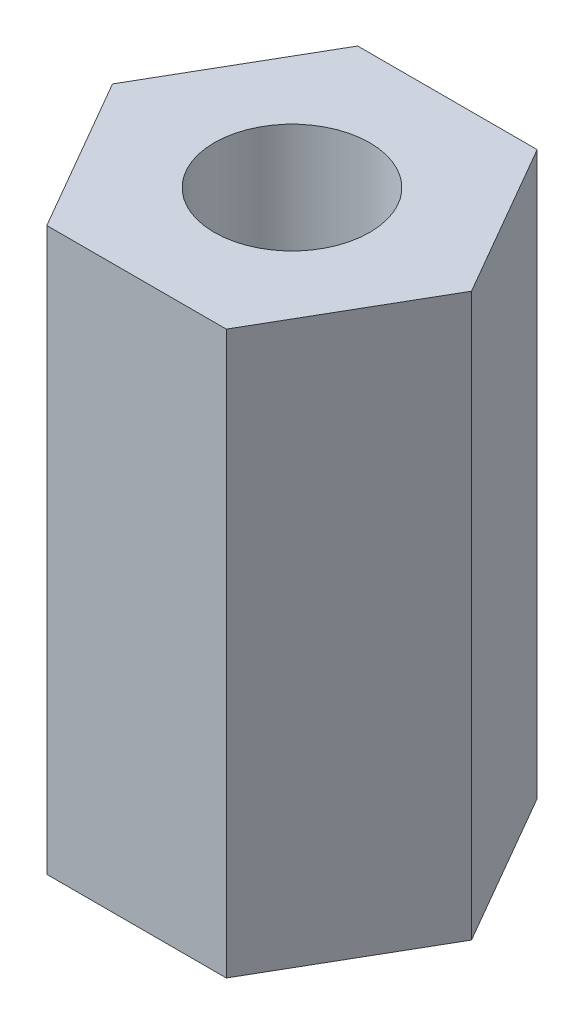
ISO-10303-21;
HEADER;
FILE_DESCRIPTION(('STEP AP214'),'2;1');
FILE_NAME('part.step','',(''),(''),'','','');
FILE_SCHEMA(('AUTOMOTIVE_DESIGN { 1 0 10303 214 1 1 1 1 }'));
ENDSEC;
DATA;
#1=APPLICATION_CONTEXT('core data for automotive mechanical design processes');
#2=APPLICATION_PROTOCOL_DEFINITION('international standard','automotive_design',2000,#1);
#3=PRODUCT_CONTEXT('',#1,'mechanical');
#4=PRODUCT('Part','Part','',(#3));
#5=PRODUCT_RELATED_PRODUCT_CATEGORY('part','',(#4));
#6=PRODUCT_DEFINITION_FORMATION('','',#4);
#7=PRODUCT_DEFINITION_CONTEXT('part definition',#1,'design');
#8=PRODUCT_DEFINITION('design','',#6,#7);
#9=PRODUCT_DEFINITION_SHAPE('','',#8);
#10=(LENGTH_UNIT() NAMED_UNIT(*) SI_UNIT(.MILLI.,.METRE.));
#11=(NAMED_UNIT(*) PLANE_ANGLE_UNIT() SI_UNIT($,.RADIAN.));
#12=(NAMED_UNIT(*) SI_UNIT($,.STERADIAN.) SOLID_ANGLE_UNIT());
#13=UNCERTAINTY_MEASURE_WITH_UNIT(LENGTH_MEASURE(1.E-05),#10,'distance_accuracy_value','');
#14=(GEOMETRIC_REPRESENTATION_CONTEXT(3) GLOBAL_UNCERTAINTY_ASSIGNED_CONTEXT((#13)) GLOBAL_UNIT_ASSIGNED_CONTEXT((#10,
#11,#12)) REPRESENTATION_CONTEXT('',''));
#15=CARTESIAN_POINT('',(0.,0.,0.));
#16=DIRECTION('',(0.,0.,1.));
#17=DIRECTION('',(1.,0.,0.));
#18=AXIS2_PLACEMENT_3D('',#15,#16,#17);
#19=CARTESIAN_POINT('',(0.,7.23,0.));
#20=DIRECTION('',(0.,1.,0.));
#21=DIRECTION('',(0.,0.,1.));
#22=AXIS2_PLACEMENT_3D('',#19,#20,#21);
#23=PLANE('',#22);
#24=DIRECTION('',(0.499999999999995,0.,-0.866025403784442));
#25=VECTOR('',#24,1.);
#26=CARTESIAN_POINT('',(1.15470053837928,7.23,1.99999999999999));
#27=LINE('',#26,#25);
#28=CARTESIAN_POINT('',(1.15470053837928,7.23,1.99999999999999));
#29=VERTEX_POINT('',#28);
#30=CARTESIAN_POINT('',(2.3094010767585,7.23,0.));
#31=VERTEX_POINT('',#30);
#32=EDGE_CURVE('E146',#29,#31,#27,.T.);
#33=ORIENTED_EDGE('',*,*,#32,.T.);
#34=DIRECTION('',(-0.500000000000001,0.,-0.866025403784438));
#35=VECTOR('',#34,1.);
#36=CARTESIAN_POINT('',(2.3094010767585,7.23,0.));
#37=LINE('',#36,#35);
#38=CARTESIAN_POINT('',(1.15470053837925,7.23,-2.));
#39=VERTEX_POINT('',#38);
#40=EDGE_CURVE('E94',#31,#39,#37,.T.);
#41=ORIENTED_EDGE('',*,*,#40,.T.);
#42=DIRECTION('',(-1.,0.,0.));
#43=VECTOR('',#42,1.);
#44=CARTESIAN_POINT('',(1.15470053837925,7.23,-2.));
#45=LINE('',#44,#43);
#46=CARTESIAN_POINT('',(-1.15470053837926,7.23,-2.));
#47=VERTEX_POINT('',#46);
#48=EDGE_CURVE('E107',#39,#47,#45,.T.);
#49=ORIENTED_EDGE('',*,*,#48,.T.);
#50=DIRECTION('',(-0.499999999999995,0.,0.866025403784442));
#51=VECTOR('',#50,1.);
#52=CARTESIAN_POINT('',(-1.15470053837926,7.23,-2.));
#53=LINE('',#52,#51);
#54=CARTESIAN_POINT('',(-2.3094010767585,7.23,0.));
#55=VERTEX_POINT('',#54);
#56=EDGE_CURVE('E101',#47,#55,#53,.T.);
#57=ORIENTED_EDGE('',*,*,#56,.T.);
#58=DIRECTION('',(0.500000000000007,0.,0.866025403784435));
#59=VECTOR('',#58,1.);
#60=CARTESIAN_POINT('',(-2.3094010767585,7.23,0.));
#61=LINE('',#60,#59);
#62=CARTESIAN_POINT('',(-1.15470053837923,7.23,2.00000000000001));
#63=VERTEX_POINT('',#62);
#64=EDGE_CURVE('E105',#55,#63,#61,.T.);
#65=ORIENTED_EDGE('',*,*,#64,.T.);
#66=DIRECTION('',(1.,0.,0.));
#67=VECTOR('',#66,1.);
#68=CARTESIAN_POINT('',(-1.15470053837923,7.23,2.00000000000001));
#69=LINE('',#68,#67);
#70=EDGE_CURVE('E57',#63,#29,#69,.T.);
#71=ORIENTED_EDGE('',*,*,#70,.T.);
#72=EDGE_LOOP('',(#33,#41,#49,#57,#65,#71));
#73=FACE_BOUND('',#72,.T.);
#74=CARTESIAN_POINT('',(0.,7.23,0.));
#75=DIRECTION('',(0.,1.,0.));
#76=DIRECTION('',(0.,0.,1.));
#77=AXIS2_PLACEMENT_3D('',#74,#75,#76);
#78=CIRCLE('',#77,1.);
#79=CARTESIAN_POINT('',(0.,7.23,1.));
#80=VERTEX_POINT('',#79);
#81=EDGE_CURVE('E134',#80,#80,#78,.T.);
#82=ORIENTED_EDGE('',*,*,#81,.F.);
#83=EDGE_LOOP('',(#82));
#84=FACE_BOUND('',#83,.T.);
#85=ADVANCED_FACE('F39',(#73,#84),#23,.T.);
#86=CARTESIAN_POINT('',(0.,0.,0.));
#87=DIRECTION('',(0.,1.,0.));
#88=DIRECTION('',(0.,0.,1.));
#89=AXIS2_PLACEMENT_3D('',#86,#87,#88);
#90=PLANE('',#89);
#91=DIRECTION('',(0.499999999999995,0.,-0.866025403784442));
#92=VECTOR('',#91,1.);
#93=CARTESIAN_POINT('',(1.15470053837928,0.,1.99999999999999));
#94=LINE('',#93,#92);
#95=CARTESIAN_POINT('',(1.15470053837928,0.,1.99999999999999));
#96=VERTEX_POINT('',#95);
#97=CARTESIAN_POINT('',(2.3094010767585,0.,0.));
#98=VERTEX_POINT('',#97);
#99=EDGE_CURVE('E129',#96,#98,#94,.T.);
#100=ORIENTED_EDGE('',*,*,#99,.F.);
#101=DIRECTION('',(1.,0.,0.));
#102=VECTOR('',#101,1.);
#103=CARTESIAN_POINT('',(-1.15470053837923,0.,2.00000000000001));
#104=LINE('',#103,#102);
#105=CARTESIAN_POINT('',(-1.15470053837923,0.,2.00000000000001));
#106=VERTEX_POINT('',#105);
#107=EDGE_CURVE('E86',#106,#96,#104,.T.);
#108=ORIENTED_EDGE('',*,*,#107,.F.);
#109=DIRECTION('',(0.500000000000007,0.,0.866025403784435));
#110=VECTOR('',#109,1.);
#111=CARTESIAN_POINT('',(-2.3094010767585,0.,0.));
#112=LINE('',#111,#110);
#113=CARTESIAN_POINT('',(-2.3094010767585,0.,0.));
#114=VERTEX_POINT('',#113);
#115=EDGE_CURVE('E80',#114,#106,#112,.T.);
#116=ORIENTED_EDGE('',*,*,#115,.F.);
#117=DIRECTION('',(-0.499999999999995,0.,0.866025403784442));
#118=VECTOR('',#117,1.);
#119=CARTESIAN_POINT('',(-1.15470053837926,0.,-2.));
#120=LINE('',#119,#118);
#121=CARTESIAN_POINT('',(-1.15470053837926,0.,-2.));
#122=VERTEX_POINT('',#121);
#123=EDGE_CURVE('E116',#122,#114,#120,.T.);
#124=ORIENTED_EDGE('',*,*,#123,.F.);
#125=DIRECTION('',(-1.,0.,0.));
#126=VECTOR('',#125,1.);
#127=CARTESIAN_POINT('',(1.15470053837925,0.,-2.));
#128=LINE('',#127,#126);
#129=CARTESIAN_POINT('',(1.15470053837925,0.,-2.));
#130=VERTEX_POINT('',#129);
#131=EDGE_CURVE('E137',#130,#122,#128,.T.);
#132=ORIENTED_EDGE('',*,*,#131,.F.);
#133=DIRECTION('',(-0.500000000000001,0.,-0.866025403784438));
#134=VECTOR('',#133,1.);
#135=CARTESIAN_POINT('',(2.3094010767585,0.,0.));
#136=LINE('',#135,#134);
#137=EDGE_CURVE('E133',#98,#130,#136,.T.);
#138=ORIENTED_EDGE('',*,*,#137,.F.);
#139=EDGE_LOOP('',(#100,#108,#116,#124,#132,#138));
#140=FACE_BOUND('',#139,.T.);
#141=CARTESIAN_POINT('',(0.,0.,0.));
#142=DIRECTION('',(0.,1.,0.));
#143=DIRECTION('',(0.,0.,1.));
#144=AXIS2_PLACEMENT_3D('',#141,#142,#143);
#145=CIRCLE('',#144,1.);
#146=CARTESIAN_POINT('',(0.,0.,1.));
#147=VERTEX_POINT('',#146);
#148=EDGE_CURVE('E243',#147,#147,#145,.T.);
#149=ORIENTED_EDGE('',*,*,#148,.T.);
#150=EDGE_LOOP('',(#149));
#151=FACE_BOUND('',#150,.T.);
#152=ADVANCED_FACE('F159',(#140,#151),#90,.F.);
#153=CARTESIAN_POINT('',(1.15470053837928,7.23,1.99999999999999));
#154=DIRECTION('',(-0.866025403784441,0.,-0.499999999999995));
#155=DIRECTION('',(-0.499999999999995,0.,0.866025403784442));
#156=AXIS2_PLACEMENT_3D('',#153,#154,#155);
#157=PLANE('',#156);
#158=ORIENTED_EDGE('',*,*,#99,.T.);
#159=DIRECTION('',(0.,-1.,0.));
#160=VECTOR('',#159,1.);
#161=CARTESIAN_POINT('',(2.3094010767585,7.23,0.));
#162=LINE('',#161,#160);
#163=EDGE_CURVE('E11',#31,#98,#162,.T.);
#164=ORIENTED_EDGE('',*,*,#163,.F.);
#165=ORIENTED_EDGE('',*,*,#32,.F.);
#166=DIRECTION('',(0.,-1.,0.));
#167=VECTOR('',#166,1.);
#168=CARTESIAN_POINT('',(1.15470053837928,7.23,1.99999999999999));
#169=LINE('',#168,#167);
#170=EDGE_CURVE('E125',#29,#96,#169,.T.);
#171=ORIENTED_EDGE('',*,*,#170,.T.);
#172=EDGE_LOOP('',(#158,#164,#165,#171));
#173=FACE_BOUND('',#172,.T.);
#174=ADVANCED_FACE('F41',(#173),#157,.F.);
#175=CARTESIAN_POINT('',(2.3094010767585,7.23,0.));
#176=DIRECTION('',(-0.866025403784438,0.,0.500000000000001));
#177=DIRECTION('',(0.500000000000001,0.,0.866025403784438));
#178=AXIS2_PLACEMENT_3D('',#175,#176,#177);
#179=PLANE('',#178);
#180=ORIENTED_EDGE('',*,*,#137,.T.);
#181=DIRECTION('',(0.,-1.,0.));
#182=VECTOR('',#181,1.);
#183=CARTESIAN_POINT('',(1.15470053837925,7.23,-2.));
#184=LINE('',#183,#182);
#185=EDGE_CURVE('E49',#39,#130,#184,.T.);
#186=ORIENTED_EDGE('',*,*,#185,.F.);
#187=ORIENTED_EDGE('',*,*,#40,.F.);
#188=ORIENTED_EDGE('',*,*,#163,.T.);
#189=EDGE_LOOP('',(#180,#186,#187,#188));
#190=FACE_BOUND('',#189,.T.);
#191=ADVANCED_FACE('F184',(#190),#179,.F.);
#192=CARTESIAN_POINT('',(1.15470053837925,7.23,-2.));
#193=DIRECTION('',(0.,0.,1.));
#194=DIRECTION('',(1.,0.,0.));
#195=AXIS2_PLACEMENT_3D('',#192,#193,#194);
#196=PLANE('',#195);
#197=ORIENTED_EDGE('',*,*,#131,.T.);
#198=DIRECTION('',(0.,-1.,0.));
#199=VECTOR('',#198,1.);
#200=CARTESIAN_POINT('',(-1.15470053837926,7.23,-2.));
#201=LINE('',#200,#199);
#202=EDGE_CURVE('E118',#47,#122,#201,.T.);
#203=ORIENTED_EDGE('',*,*,#202,.F.);
#204=ORIENTED_EDGE('',*,*,#48,.F.);
#205=ORIENTED_EDGE('',*,*,#185,.T.);
#206=EDGE_LOOP('',(#197,#203,#204,#205));
#207=FACE_BOUND('',#206,.T.);
#208=ADVANCED_FACE('F156',(#207),#196,.F.);
#209=CARTESIAN_POINT('',(-1.15470053837926,7.23,-2.));
#210=DIRECTION('',(0.866025403784442,0.,0.499999999999995));
#211=DIRECTION('',(0.499999999999995,0.,-0.866025403784442));
#212=AXIS2_PLACEMENT_3D('',#209,#210,#211);
#213=PLANE('',#212);
#214=ORIENTED_EDGE('',*,*,#123,.T.);
#215=DIRECTION('',(0.,-1.,0.));
#216=VECTOR('',#215,1.);
#217=CARTESIAN_POINT('',(-2.3094010767585,7.23,0.));
#218=LINE('',#217,#216);
#219=EDGE_CURVE('E113',#55,#114,#218,.T.);
#220=ORIENTED_EDGE('',*,*,#219,.F.);
#221=ORIENTED_EDGE('',*,*,#56,.F.);
#222=ORIENTED_EDGE('',*,*,#202,.T.);
#223=EDGE_LOOP('',(#214,#220,#221,#222));
#224=FACE_BOUND('',#223,.T.);
#225=ADVANCED_FACE('F114',(#224),#213,.F.);
#226=CARTESIAN_POINT('',(-2.3094010767585,7.23,0.));
#227=DIRECTION('',(0.866025403784435,0.,-0.500000000000007));
#228=DIRECTION('',(-0.500000000000007,0.,-0.866025403784435));
#229=AXIS2_PLACEMENT_3D('',#226,#227,#228);
#230=PLANE('',#229);
#231=ORIENTED_EDGE('',*,*,#115,.T.);
#232=DIRECTION('',(0.,-1.,0.));
#233=VECTOR('',#232,1.);
#234=CARTESIAN_POINT('',(-1.15470053837923,7.23,2.00000000000001));
#235=LINE('',#234,#233);
#236=EDGE_CURVE('E119',#63,#106,#235,.T.);
#237=ORIENTED_EDGE('',*,*,#236,.F.);
#238=ORIENTED_EDGE('',*,*,#64,.F.);
#239=ORIENTED_EDGE('',*,*,#219,.T.);
#240=EDGE_LOOP('',(#231,#237,#238,#239));
#241=FACE_BOUND('',#240,.T.);
#242=ADVANCED_FACE('F121',(#241),#230,.F.);
#243=CARTESIAN_POINT('',(-1.15470053837923,7.23,2.00000000000001));
#244=DIRECTION('',(0.,0.,-1.));
#245=DIRECTION('',(-1.,0.,0.));
#246=AXIS2_PLACEMENT_3D('',#243,#244,#245);
#247=PLANE('',#246);
#248=ORIENTED_EDGE('',*,*,#107,.T.);
#249=ORIENTED_EDGE('',*,*,#170,.F.);
#250=ORIENTED_EDGE('',*,*,#70,.F.);
#251=ORIENTED_EDGE('',*,*,#236,.T.);
#252=EDGE_LOOP('',(#248,#249,#250,#251));
#253=FACE_BOUND('',#252,.T.);
#254=ADVANCED_FACE('F164',(#253),#247,.F.);
#255=CARTESIAN_POINT('',(0.,7.23,0.));
#256=DIRECTION('',(0.,-1.,0.));
#257=DIRECTION('',(0.,0.,-1.));
#258=AXIS2_PLACEMENT_3D('',#255,#256,#257);
#259=CYLINDRICAL_SURFACE('',#258,1.);
#260=ORIENTED_EDGE('',*,*,#81,.T.);
#261=EDGE_LOOP('',(#260));
#262=FACE_BOUND('',#261,.T.);
#263=ORIENTED_EDGE('',*,*,#148,.F.);
#264=EDGE_LOOP('',(#263));
#265=FACE_BOUND('',#264,.T.);
#266=ADVANCED_FACE('F166',(#262,#265),#259,.F.);
#267=CLOSED_SHELL('',(#85,#152,#174,#191,#208,#225,#242,#254,#266));
#268=MANIFOLD_SOLID_BREP('B2',#267);
#269=ADVANCED_BREP_SHAPE_REPRESENTATION('',(#18,#268),#14);
#270=SHAPE_DEFINITION_REPRESENTATION(#9,#269);
ENDSEC;
END-ISO-10303-21;
